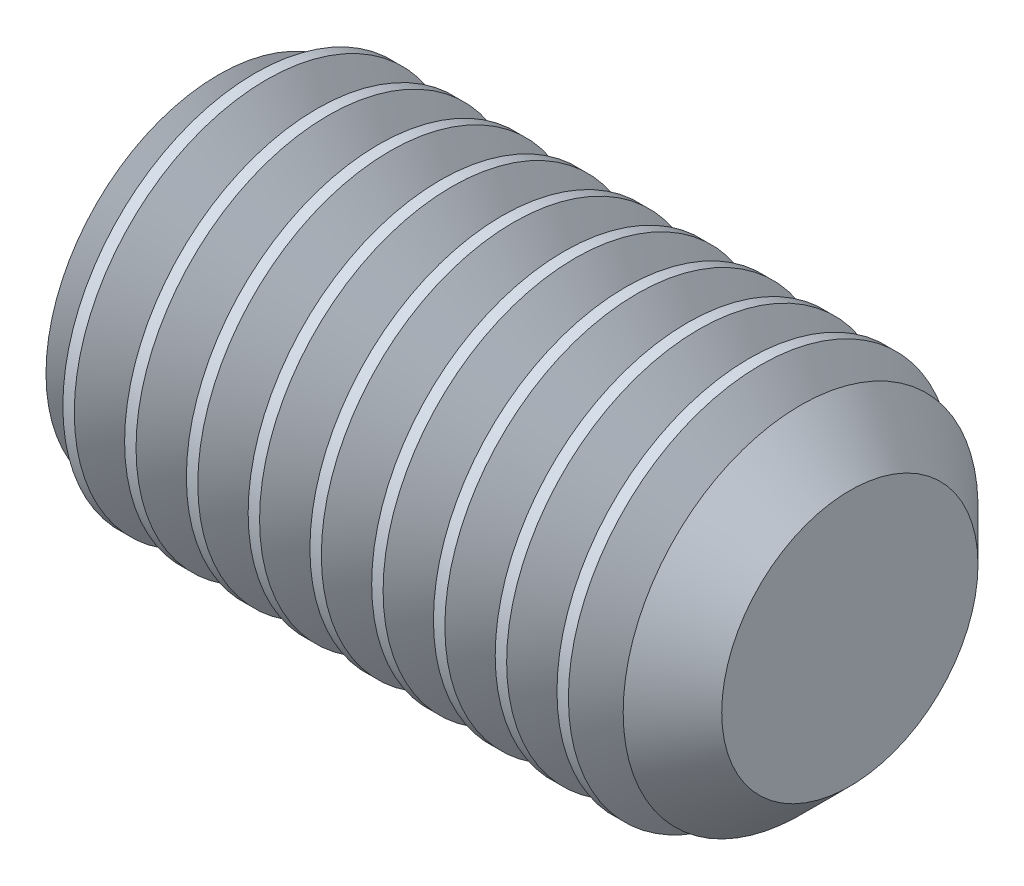
ISO-10303-21;
HEADER;
FILE_DESCRIPTION(('STEP AP214'),'2;1');
FILE_NAME('part.step','',(''),(''),'','','');
FILE_SCHEMA(('AUTOMOTIVE_DESIGN { 1 0 10303 214 1 1 1 1 }'));
ENDSEC;
DATA;
#1=APPLICATION_CONTEXT('core data for automotive mechanical design processes');
#2=APPLICATION_PROTOCOL_DEFINITION('international standard','automotive_design',2000,#1);
#3=PRODUCT_CONTEXT('',#1,'mechanical');
#4=PRODUCT('Part','Part','',(#3));
#5=PRODUCT_RELATED_PRODUCT_CATEGORY('part','',(#4));
#6=PRODUCT_DEFINITION_FORMATION('','',#4);
#7=PRODUCT_DEFINITION_CONTEXT('part definition',#1,'design');
#8=PRODUCT_DEFINITION('design','',#6,#7);
#9=PRODUCT_DEFINITION_SHAPE('','',#8);
#10=(LENGTH_UNIT() NAMED_UNIT(*) SI_UNIT(.MILLI.,.METRE.));
#11=(NAMED_UNIT(*) PLANE_ANGLE_UNIT() SI_UNIT($,.RADIAN.));
#12=(NAMED_UNIT(*) SI_UNIT($,.STERADIAN.) SOLID_ANGLE_UNIT());
#13=UNCERTAINTY_MEASURE_WITH_UNIT(LENGTH_MEASURE(1.E-05),#10,'distance_accuracy_value','');
#14=(GEOMETRIC_REPRESENTATION_CONTEXT(3) GLOBAL_UNCERTAINTY_ASSIGNED_CONTEXT((#13)) GLOBAL_UNIT_ASSIGNED_CONTEXT((#10,
#11,#12)) REPRESENTATION_CONTEXT('',''));
#15=CARTESIAN_POINT('',(0.,0.,0.));
#16=DIRECTION('',(0.,0.,1.));
#17=DIRECTION('',(1.,0.,0.));
#18=AXIS2_PLACEMENT_3D('',#15,#16,#17);
#19=CARTESIAN_POINT('',(0.,0.,0.));
#20=DIRECTION('',(-1.,0.,0.));
#21=DIRECTION('',(0.,0.,1.));
#22=AXIS2_PLACEMENT_3D('',#19,#20,#21);
#23=PLANE('',#22);
#24=CARTESIAN_POINT('',(0.,0.,0.));
#25=DIRECTION('',(-1.,0.,0.));
#26=DIRECTION('',(0.,0.,1.));
#27=AXIS2_PLACEMENT_3D('',#24,#25,#26);
#28=CIRCLE('',#27,1.2195);
#29=CARTESIAN_POINT('',(0.,0.,1.2195));
#30=VERTEX_POINT('',#29);
#31=EDGE_CURVE('E46',#30,#30,#28,.T.);
#32=ORIENTED_EDGE('',*,*,#31,.T.);
#33=EDGE_LOOP('',(#32));
#34=FACE_BOUND('',#33,.T.);
#35=DIRECTION('',(0.,0.,-1.));
#36=VECTOR('',#35,1.);
#37=CARTESIAN_POINT('',(0.,0.750000000000003,0.433012701892217));
#38=LINE('',#37,#36);
#39=CARTESIAN_POINT('',(0.,0.750000000000003,0.433012701892217));
#40=VERTEX_POINT('',#39);
#41=CARTESIAN_POINT('',(0.,0.750000000000003,-0.433012701892222));
#42=VERTEX_POINT('',#41);
#43=EDGE_CURVE('E133',#40,#42,#38,.T.);
#44=ORIENTED_EDGE('',*,*,#43,.F.);
#45=DIRECTION('',(0.,-0.866025403784439,0.5));
#46=VECTOR('',#45,1.);
#47=CARTESIAN_POINT('',(0.,0.750000000000003,0.433012701892217));
#48=LINE('',#47,#46);
#49=CARTESIAN_POINT('',(0.,0.,0.866025403784436));
#50=VERTEX_POINT('',#49);
#51=EDGE_CURVE('E54',#40,#50,#48,.T.);
#52=ORIENTED_EDGE('',*,*,#51,.T.);
#53=DIRECTION('',(0.,0.866025403784439,0.5));
#54=VECTOR('',#53,1.);
#55=CARTESIAN_POINT('',(0.,-0.749999999999997,0.433012701892216));
#56=LINE('',#55,#54);
#57=CARTESIAN_POINT('',(0.,-0.749999999999997,0.433012701892216));
#58=VERTEX_POINT('',#57);
#59=EDGE_CURVE('E123',#58,#50,#56,.T.);
#60=ORIENTED_EDGE('',*,*,#59,.F.);
#61=DIRECTION('',(0.,0.,-1.));
#62=VECTOR('',#61,1.);
#63=CARTESIAN_POINT('',(0.,-0.749999999999997,0.433012701892216));
#64=LINE('',#63,#62);
#65=CARTESIAN_POINT('',(0.,-0.749999999999997,-0.433012701892222));
#66=VERTEX_POINT('',#65);
#67=EDGE_CURVE('E127',#58,#66,#64,.T.);
#68=ORIENTED_EDGE('',*,*,#67,.T.);
#69=DIRECTION('',(0.,0.866025403784439,-0.5));
#70=VECTOR('',#69,1.);
#71=CARTESIAN_POINT('',(0.,-0.749999999999997,-0.433012701892222));
#72=LINE('',#71,#70);
#73=CARTESIAN_POINT('',(0.,0.,-0.866025403784441));
#74=VERTEX_POINT('',#73);
#75=EDGE_CURVE('E130',#66,#74,#72,.T.);
#76=ORIENTED_EDGE('',*,*,#75,.T.);
#77=DIRECTION('',(0.,-0.866025403784439,-0.5));
#78=VECTOR('',#77,1.);
#79=CARTESIAN_POINT('',(0.,0.750000000000003,-0.433012701892222));
#80=LINE('',#79,#78);
#81=EDGE_CURVE('E112',#42,#74,#80,.T.);
#82=ORIENTED_EDGE('',*,*,#81,.F.);
#83=EDGE_LOOP('',(#44,#52,#60,#68,#76,#82));
#84=FACE_BOUND('',#83,.T.);
#85=ADVANCED_FACE('F37',(#34,#84),#23,.T.);
#86=CARTESIAN_POINT('',(0.,0.,0.));
#87=DIRECTION('',(1.,0.,0.));
#88=DIRECTION('',(0.,0.,-1.));
#89=AXIS2_PLACEMENT_3D('',#86,#87,#88);
#90=CONICAL_SURFACE('',#89,1.2195,1.0471975511966);
#91=CARTESIAN_POINT('',(0.0731865121550403,0.,0.));
#92=DIRECTION('',(-1.,0.,0.));
#93=DIRECTION('',(0.,-1.,0.));
#94=AXIS2_PLACEMENT_3D('',#91,#92,#93);
#95=CIRCLE('',#94,1.34626275748129);
#96=CARTESIAN_POINT('',(0.0731865121550405,-1.34626275748129,0.));
#97=VERTEX_POINT('',#96);
#98=EDGE_CURVE('E124',#97,#97,#95,.F.);
#99=ORIENTED_EDGE('',*,*,#98,.F.);
#100=EDGE_LOOP('',(#99));
#101=FACE_BOUND('',#100,.T.);
#102=ORIENTED_EDGE('',*,*,#31,.F.);
#103=EDGE_LOOP('',(#102));
#104=FACE_BOUND('',#103,.T.);
#105=ADVANCED_FACE('F169',(#101,#104),#90,.T.);
#106=CARTESIAN_POINT('',(2.1,0.750000000000003,0.433012701892217));
#107=DIRECTION('',(0.,-0.5,-0.866025403784439));
#108=DIRECTION('',(0.,0.866025403784439,-0.5));
#109=AXIS2_PLACEMENT_3D('',#106,#107,#108);
#110=PLANE('',#109);
#111=ORIENTED_EDGE('',*,*,#51,.F.);
#112=DIRECTION('',(-1.,0.,0.));
#113=VECTOR('',#112,1.);
#114=CARTESIAN_POINT('',(2.1,0.750000000000003,0.433012701892217));
#115=LINE('',#114,#113);
#116=CARTESIAN_POINT('',(2.1,0.750000000000003,0.433012701892217));
#117=VERTEX_POINT('',#116);
#118=EDGE_CURVE('E59',#117,#40,#115,.T.);
#119=ORIENTED_EDGE('',*,*,#118,.F.);
#120=DIRECTION('',(0.,-0.866025403784439,0.5));
#121=VECTOR('',#120,1.);
#122=CARTESIAN_POINT('',(2.1,0.750000000000003,0.433012701892217));
#123=LINE('',#122,#121);
#124=CARTESIAN_POINT('',(2.1,0.,0.866025403784436));
#125=VERTEX_POINT('',#124);
#126=EDGE_CURVE('E86',#117,#125,#123,.T.);
#127=ORIENTED_EDGE('',*,*,#126,.T.);
#128=DIRECTION('',(-1.,0.,0.));
#129=VECTOR('',#128,1.);
#130=CARTESIAN_POINT('',(2.1,0.,0.866025403784436));
#131=LINE('',#130,#129);
#132=EDGE_CURVE('E140',#125,#50,#131,.T.);
#133=ORIENTED_EDGE('',*,*,#132,.T.);
#134=EDGE_LOOP('',(#111,#119,#127,#133));
#135=FACE_BOUND('',#134,.T.);
#136=ADVANCED_FACE('F167',(#135),#110,.T.);
#137=CARTESIAN_POINT('',(2.1,-0.749999999999997,0.433012701892216));
#138=DIRECTION('',(0.,-0.5,0.866025403784439));
#139=DIRECTION('',(0.,-0.866025403784439,-0.5));
#140=AXIS2_PLACEMENT_3D('',#137,#138,#139);
#141=PLANE('',#140);
#142=ORIENTED_EDGE('',*,*,#59,.T.);
#143=ORIENTED_EDGE('',*,*,#132,.F.);
#144=DIRECTION('',(0.,0.866025403784439,0.5));
#145=VECTOR('',#144,1.);
#146=CARTESIAN_POINT('',(2.1,-0.749999999999997,0.433012701892216));
#147=LINE('',#146,#145);
#148=CARTESIAN_POINT('',(2.1,-0.749999999999997,0.433012701892216));
#149=VERTEX_POINT('',#148);
#150=EDGE_CURVE('E158',#149,#125,#147,.T.);
#151=ORIENTED_EDGE('',*,*,#150,.F.);
#152=DIRECTION('',(-1.,0.,0.));
#153=VECTOR('',#152,1.);
#154=CARTESIAN_POINT('',(2.1,-0.749999999999997,0.433012701892216));
#155=LINE('',#154,#153);
#156=EDGE_CURVE('E138',#149,#58,#155,.T.);
#157=ORIENTED_EDGE('',*,*,#156,.T.);
#158=EDGE_LOOP('',(#142,#143,#151,#157));
#159=FACE_BOUND('',#158,.T.);
#160=ADVANCED_FACE('F165',(#159),#141,.F.);
#161=CARTESIAN_POINT('',(2.1,-0.749999999999997,0.433012701892216));
#162=DIRECTION('',(0.,1.,0.));
#163=DIRECTION('',(0.,0.,1.));
#164=AXIS2_PLACEMENT_3D('',#161,#162,#163);
#165=PLANE('',#164);
#166=ORIENTED_EDGE('',*,*,#67,.F.);
#167=ORIENTED_EDGE('',*,*,#156,.F.);
#168=DIRECTION('',(0.,0.,-1.));
#169=VECTOR('',#168,1.);
#170=CARTESIAN_POINT('',(2.1,-0.749999999999997,0.433012701892216));
#171=LINE('',#170,#169);
#172=CARTESIAN_POINT('',(2.1,-0.749999999999997,-0.433012701892222));
#173=VERTEX_POINT('',#172);
#174=EDGE_CURVE('E107',#149,#173,#171,.T.);
#175=ORIENTED_EDGE('',*,*,#174,.T.);
#176=DIRECTION('',(-1.,0.,0.));
#177=VECTOR('',#176,1.);
#178=CARTESIAN_POINT('',(2.1,-0.749999999999997,-0.433012701892222));
#179=LINE('',#178,#177);
#180=EDGE_CURVE('E102',#173,#66,#179,.T.);
#181=ORIENTED_EDGE('',*,*,#180,.T.);
#182=EDGE_LOOP('',(#166,#167,#175,#181));
#183=FACE_BOUND('',#182,.T.);
#184=ADVANCED_FACE('F162',(#183),#165,.T.);
#185=CARTESIAN_POINT('',(2.1,-0.749999999999997,-0.433012701892222));
#186=DIRECTION('',(0.,0.5,0.866025403784439));
#187=DIRECTION('',(0.,-0.866025403784439,0.5));
#188=AXIS2_PLACEMENT_3D('',#185,#186,#187);
#189=PLANE('',#188);
#190=ORIENTED_EDGE('',*,*,#75,.F.);
#191=ORIENTED_EDGE('',*,*,#180,.F.);
#192=DIRECTION('',(0.,0.866025403784439,-0.5));
#193=VECTOR('',#192,1.);
#194=CARTESIAN_POINT('',(2.1,-0.749999999999997,-0.433012701892222));
#195=LINE('',#194,#193);
#196=CARTESIAN_POINT('',(2.1,0.,-0.866025403784441));
#197=VERTEX_POINT('',#196);
#198=EDGE_CURVE('E97',#173,#197,#195,.T.);
#199=ORIENTED_EDGE('',*,*,#198,.T.);
#200=DIRECTION('',(-1.,0.,0.));
#201=VECTOR('',#200,1.);
#202=CARTESIAN_POINT('',(2.1,0.,-0.866025403784441));
#203=LINE('',#202,#201);
#204=EDGE_CURVE('E101',#197,#74,#203,.T.);
#205=ORIENTED_EDGE('',*,*,#204,.T.);
#206=EDGE_LOOP('',(#190,#191,#199,#205));
#207=FACE_BOUND('',#206,.T.);
#208=ADVANCED_FACE('F100',(#207),#189,.T.);
#209=CARTESIAN_POINT('',(2.1,0.750000000000003,-0.433012701892222));
#210=DIRECTION('',(0.,0.5,-0.866025403784439));
#211=DIRECTION('',(0.,0.866025403784439,0.5));
#212=AXIS2_PLACEMENT_3D('',#209,#210,#211);
#213=PLANE('',#212);
#214=ORIENTED_EDGE('',*,*,#81,.T.);
#215=ORIENTED_EDGE('',*,*,#204,.F.);
#216=DIRECTION('',(0.,-0.866025403784439,-0.5));
#217=VECTOR('',#216,1.);
#218=CARTESIAN_POINT('',(2.1,0.750000000000003,-0.433012701892222));
#219=LINE('',#218,#217);
#220=CARTESIAN_POINT('',(2.1,0.750000000000003,-0.433012701892222));
#221=VERTEX_POINT('',#220);
#222=EDGE_CURVE('E106',#221,#197,#219,.T.);
#223=ORIENTED_EDGE('',*,*,#222,.F.);
#224=DIRECTION('',(-1.,0.,0.));
#225=VECTOR('',#224,1.);
#226=CARTESIAN_POINT('',(2.1,0.750000000000003,-0.433012701892222));
#227=LINE('',#226,#225);
#228=EDGE_CURVE('E82',#221,#42,#227,.T.);
#229=ORIENTED_EDGE('',*,*,#228,.T.);
#230=EDGE_LOOP('',(#214,#215,#223,#229));
#231=FACE_BOUND('',#230,.T.);
#232=ADVANCED_FACE('F109',(#231),#213,.F.);
#233=CARTESIAN_POINT('',(2.1,0.750000000000003,0.433012701892217));
#234=DIRECTION('',(0.,1.,0.));
#235=DIRECTION('',(0.,0.,1.));
#236=AXIS2_PLACEMENT_3D('',#233,#234,#235);
#237=PLANE('',#236);
#238=ORIENTED_EDGE('',*,*,#43,.T.);
#239=ORIENTED_EDGE('',*,*,#228,.F.);
#240=DIRECTION('',(0.,0.,-1.));
#241=VECTOR('',#240,1.);
#242=CARTESIAN_POINT('',(2.1,0.750000000000003,0.433012701892217));
#243=LINE('',#242,#241);
#244=EDGE_CURVE('E117',#117,#221,#243,.T.);
#245=ORIENTED_EDGE('',*,*,#244,.F.);
#246=ORIENTED_EDGE('',*,*,#118,.T.);
#247=EDGE_LOOP('',(#238,#239,#245,#246));
#248=FACE_BOUND('',#247,.T.);
#249=ADVANCED_FACE('F412',(#248),#237,.F.);
#250=CARTESIAN_POINT('',(2.1,0.750000000000003,0.433012701892217));
#251=DIRECTION('',(1.,0.,0.));
#252=DIRECTION('',(0.,0.,-1.));
#253=AXIS2_PLACEMENT_3D('',#250,#251,#252);
#254=PLANE('',#253);
#255=ORIENTED_EDGE('',*,*,#126,.F.);
#256=ORIENTED_EDGE('',*,*,#244,.T.);
#257=ORIENTED_EDGE('',*,*,#222,.T.);
#258=ORIENTED_EDGE('',*,*,#198,.F.);
#259=ORIENTED_EDGE('',*,*,#174,.F.);
#260=ORIENTED_EDGE('',*,*,#150,.T.);
#261=EDGE_LOOP('',(#255,#256,#257,#258,#259,#260));
#262=FACE_BOUND('',#261,.T.);
#263=ADVANCED_FACE('F115',(#262),#254,.F.);
#264=CARTESIAN_POINT('',(0.358354964975511,0.,0.));
#265=DIRECTION('',(1.,0.,0.));
#266=DIRECTION('',(0.,1.,0.));
#267=AXIS2_PLACEMENT_3D('',#264,#265,#266);
#268=CONICAL_SURFACE('',#267,1.5,0.959931088596883);
#269=CARTESIAN_POINT('',(0.161946750507689,0.,0.));
#270=DIRECTION('',(-1.,0.,0.));
#271=DIRECTION('',(0.,-1.,0.));
#272=AXIS2_PLACEMENT_3D('',#269,#270,#271);
#273=CIRCLE('',#272,1.2195);
#274=CARTESIAN_POINT('',(0.161946750507689,-1.2195,0.));
#275=VERTEX_POINT('',#274);
#276=EDGE_CURVE('E148',#275,#275,#273,.T.);
#277=ORIENTED_EDGE('',*,*,#276,.F.);
#278=EDGE_LOOP('',(#277));
#279=FACE_BOUND('',#278,.T.);
#280=CARTESIAN_POINT('',(0.358354964975511,0.,0.));
#281=DIRECTION('',(-1.,0.,0.));
#282=DIRECTION('',(0.,-1.,0.));
#283=AXIS2_PLACEMENT_3D('',#280,#281,#282);
#284=CIRCLE('',#283,1.5);
#285=CARTESIAN_POINT('',(0.358354964975512,-1.5,0.));
#286=VERTEX_POINT('',#285);
#287=EDGE_CURVE('E144',#286,#286,#284,.T.);
#288=ORIENTED_EDGE('',*,*,#287,.T.);
#289=EDGE_LOOP('',(#288));
#290=FACE_BOUND('',#289,.T.);
#291=ADVANCED_FACE('F406',(#279,#290),#268,.T.);
#292=CARTESIAN_POINT('',(0.161946750507689,0.,0.));
#293=DIRECTION('',(-1.,0.,0.));
#294=DIRECTION('',(0.,-1.,0.));
#295=AXIS2_PLACEMENT_3D('',#292,#293,#294);
#296=CONICAL_SURFACE('',#295,1.2195,0.959931088596876);
#297=ORIENTED_EDGE('',*,*,#98,.T.);
#298=EDGE_LOOP('',(#297));
#299=FACE_BOUND('',#298,.T.);
#300=ORIENTED_EDGE('',*,*,#276,.T.);
#301=EDGE_LOOP('',(#300));
#302=FACE_BOUND('',#301,.T.);
#303=ADVANCED_FACE('F188',(#299,#302),#296,.T.);
#304=CARTESIAN_POINT('',(-12.7,0.,0.));
#305=DIRECTION('',(-1.,0.,0.));
#306=DIRECTION('',(0.,0.,1.));
#307=AXIS2_PLACEMENT_3D('',#304,#305,#306);
#308=CYLINDRICAL_SURFACE('',#307,1.5);
#309=CARTESIAN_POINT('',(0.447544458966775,0.,0.));
#310=DIRECTION('',(-1.,0.,0.));
#311=DIRECTION('',(0.,-1.,0.));
#312=AXIS2_PLACEMENT_3D('',#309,#310,#311);
#313=CIRCLE('',#312,1.5);
#314=CARTESIAN_POINT('',(0.447544458966776,-1.5,0.));
#315=VERTEX_POINT('',#314);
#316=EDGE_CURVE('E280',#315,#315,#313,.T.);
#317=ORIENTED_EDGE('',*,*,#316,.T.);
#318=EDGE_LOOP('',(#317));
#319=FACE_BOUND('',#318,.T.);
#320=ORIENTED_EDGE('',*,*,#287,.F.);
#321=EDGE_LOOP('',(#320));
#322=FACE_BOUND('',#321,.T.);
#323=ADVANCED_FACE('F185',(#319,#322),#308,.T.);
#324=CARTESIAN_POINT('',(0.840360887902424,0.,0.));
#325=DIRECTION('',(1.,0.,0.));
#326=DIRECTION('',(0.,1.,0.));
#327=AXIS2_PLACEMENT_3D('',#324,#325,#326);
#328=CONICAL_SURFACE('',#327,1.5,0.959931088596883);
#329=CARTESIAN_POINT('',(0.643952673434601,0.,0.));
#330=DIRECTION('',(-1.,0.,0.));
#331=DIRECTION('',(0.,-1.,0.));
#332=AXIS2_PLACEMENT_3D('',#329,#330,#331);
#333=CIRCLE('',#332,1.2195);
#334=CARTESIAN_POINT('',(0.643952673434601,-1.2195,0.));
#335=VERTEX_POINT('',#334);
#336=EDGE_CURVE('E277',#335,#335,#333,.T.);
#337=ORIENTED_EDGE('',*,*,#336,.F.);
#338=EDGE_LOOP('',(#337));
#339=FACE_BOUND('',#338,.T.);
#340=CARTESIAN_POINT('',(0.840360887902424,0.,0.));
#341=DIRECTION('',(-1.,0.,0.));
#342=DIRECTION('',(0.,-1.,0.));
#343=AXIS2_PLACEMENT_3D('',#340,#341,#342);
#344=CIRCLE('',#343,1.5);
#345=CARTESIAN_POINT('',(0.840360887902424,-1.5,0.));
#346=VERTEX_POINT('',#345);
#347=EDGE_CURVE('E153',#346,#346,#344,.T.);
#348=ORIENTED_EDGE('',*,*,#347,.T.);
#349=EDGE_LOOP('',(#348));
#350=FACE_BOUND('',#349,.T.);
#351=ADVANCED_FACE('F187',(#339,#350),#328,.T.);
#352=CARTESIAN_POINT('',(0.643952673434601,0.,0.));
#353=DIRECTION('',(-1.,0.,0.));
#354=DIRECTION('',(0.,-1.,0.));
#355=AXIS2_PLACEMENT_3D('',#352,#353,#354);
#356=CONICAL_SURFACE('',#355,1.2195,0.959931088596876);
#357=ORIENTED_EDGE('',*,*,#316,.F.);
#358=EDGE_LOOP('',(#357));
#359=FACE_BOUND('',#358,.T.);
#360=ORIENTED_EDGE('',*,*,#336,.T.);
#361=EDGE_LOOP('',(#360));
#362=FACE_BOUND('',#361,.T.);
#363=ADVANCED_FACE('F288',(#359,#362),#356,.T.);
#364=CARTESIAN_POINT('',(0.929550381893688,0.,0.));
#365=DIRECTION('',(-1.,0.,0.));
#366=DIRECTION('',(0.,-1.,0.));
#367=AXIS2_PLACEMENT_3D('',#364,#365,#366);
#368=CIRCLE('',#367,1.5);
#369=CARTESIAN_POINT('',(0.929550381893688,-1.5,0.));
#370=VERTEX_POINT('',#369);
#371=EDGE_CURVE('E271',#370,#370,#368,.T.);
#372=ORIENTED_EDGE('',*,*,#371,.T.);
#373=EDGE_LOOP('',(#372));
#374=FACE_BOUND('',#373,.T.);
#375=ORIENTED_EDGE('',*,*,#347,.F.);
#376=EDGE_LOOP('',(#375));
#377=FACE_BOUND('',#376,.T.);
#378=ADVANCED_FACE('F191',(#374,#377),#308,.T.);
#379=CARTESIAN_POINT('',(1.32236681082934,0.,0.));
#380=DIRECTION('',(1.,0.,0.));
#381=DIRECTION('',(0.,1.,0.));
#382=AXIS2_PLACEMENT_3D('',#379,#380,#381);
#383=CONICAL_SURFACE('',#382,1.5,0.959931088596883);
#384=CARTESIAN_POINT('',(1.12595859636151,0.,0.));
#385=DIRECTION('',(-1.,0.,0.));
#386=DIRECTION('',(0.,-1.,0.));
#387=AXIS2_PLACEMENT_3D('',#384,#385,#386);
#388=CIRCLE('',#387,1.2195);
#389=CARTESIAN_POINT('',(1.12595859636151,-1.2195,0.));
#390=VERTEX_POINT('',#389);
#391=EDGE_CURVE('E268',#390,#390,#388,.T.);
#392=ORIENTED_EDGE('',*,*,#391,.F.);
#393=EDGE_LOOP('',(#392));
#394=FACE_BOUND('',#393,.T.);
#395=CARTESIAN_POINT('',(1.32236681082934,0.,0.));
#396=DIRECTION('',(-1.,0.,0.));
#397=DIRECTION('',(0.,-1.,0.));
#398=AXIS2_PLACEMENT_3D('',#395,#396,#397);
#399=CIRCLE('',#398,1.5);
#400=CARTESIAN_POINT('',(1.32236681082934,-1.5,0.));
#401=VERTEX_POINT('',#400);
#402=EDGE_CURVE('E274',#401,#401,#399,.T.);
#403=ORIENTED_EDGE('',*,*,#402,.T.);
#404=EDGE_LOOP('',(#403));
#405=FACE_BOUND('',#404,.T.);
#406=ADVANCED_FACE('F287',(#394,#405),#383,.T.);
#407=CARTESIAN_POINT('',(1.12595859636151,0.,0.));
#408=DIRECTION('',(-1.,0.,0.));
#409=DIRECTION('',(0.,-1.,0.));
#410=AXIS2_PLACEMENT_3D('',#407,#408,#409);
#411=CONICAL_SURFACE('',#410,1.2195,0.959931088596876);
#412=ORIENTED_EDGE('',*,*,#371,.F.);
#413=EDGE_LOOP('',(#412));
#414=FACE_BOUND('',#413,.T.);
#415=ORIENTED_EDGE('',*,*,#391,.T.);
#416=EDGE_LOOP('',(#415));
#417=FACE_BOUND('',#416,.T.);
#418=ADVANCED_FACE('F295',(#414,#417),#411,.T.);
#419=CARTESIAN_POINT('',(1.4115563048206,0.,0.));
#420=DIRECTION('',(-1.,0.,0.));
#421=DIRECTION('',(0.,-1.,0.));
#422=AXIS2_PLACEMENT_3D('',#419,#420,#421);
#423=CIRCLE('',#422,1.5);
#424=CARTESIAN_POINT('',(1.4115563048206,-1.5,0.));
#425=VERTEX_POINT('',#424);
#426=EDGE_CURVE('E262',#425,#425,#423,.T.);
#427=ORIENTED_EDGE('',*,*,#426,.T.);
#428=EDGE_LOOP('',(#427));
#429=FACE_BOUND('',#428,.T.);
#430=ORIENTED_EDGE('',*,*,#402,.F.);
#431=EDGE_LOOP('',(#430));
#432=FACE_BOUND('',#431,.T.);
#433=ADVANCED_FACE('F290',(#429,#432),#308,.T.);
#434=CARTESIAN_POINT('',(1.80437273375625,0.,0.));
#435=DIRECTION('',(1.,0.,0.));
#436=DIRECTION('',(0.,1.,0.));
#437=AXIS2_PLACEMENT_3D('',#434,#435,#436);
#438=CONICAL_SURFACE('',#437,1.5,0.959931088596883);
#439=CARTESIAN_POINT('',(1.60796451928843,0.,0.));
#440=DIRECTION('',(-1.,0.,0.));
#441=DIRECTION('',(0.,-1.,0.));
#442=AXIS2_PLACEMENT_3D('',#439,#440,#441);
#443=CIRCLE('',#442,1.2195);
#444=CARTESIAN_POINT('',(1.60796451928843,-1.2195,0.));
#445=VERTEX_POINT('',#444);
#446=EDGE_CURVE('E259',#445,#445,#443,.T.);
#447=ORIENTED_EDGE('',*,*,#446,.F.);
#448=EDGE_LOOP('',(#447));
#449=FACE_BOUND('',#448,.T.);
#450=CARTESIAN_POINT('',(1.80437273375625,0.,0.));
#451=DIRECTION('',(-1.,0.,0.));
#452=DIRECTION('',(0.,-1.,0.));
#453=AXIS2_PLACEMENT_3D('',#450,#451,#452);
#454=CIRCLE('',#453,1.5);
#455=CARTESIAN_POINT('',(1.80437273375625,-1.5,0.));
#456=VERTEX_POINT('',#455);
#457=EDGE_CURVE('E265',#456,#456,#454,.T.);
#458=ORIENTED_EDGE('',*,*,#457,.T.);
#459=EDGE_LOOP('',(#458));
#460=FACE_BOUND('',#459,.T.);
#461=ADVANCED_FACE('F301',(#449,#460),#438,.T.);
#462=CARTESIAN_POINT('',(1.60796451928843,0.,0.));
#463=DIRECTION('',(-1.,0.,0.));
#464=DIRECTION('',(0.,-1.,0.));
#465=AXIS2_PLACEMENT_3D('',#462,#463,#464);
#466=CONICAL_SURFACE('',#465,1.2195,0.959931088596876);
#467=ORIENTED_EDGE('',*,*,#426,.F.);
#468=EDGE_LOOP('',(#467));
#469=FACE_BOUND('',#468,.T.);
#470=ORIENTED_EDGE('',*,*,#446,.T.);
#471=EDGE_LOOP('',(#470));
#472=FACE_BOUND('',#471,.T.);
#473=ADVANCED_FACE('F308',(#469,#472),#466,.T.);
#474=CARTESIAN_POINT('',(1.89356222774751,0.,0.));
#475=DIRECTION('',(-1.,0.,0.));
#476=DIRECTION('',(0.,-1.,0.));
#477=AXIS2_PLACEMENT_3D('',#474,#475,#476);
#478=CIRCLE('',#477,1.5);
#479=CARTESIAN_POINT('',(1.89356222774751,-1.5,0.));
#480=VERTEX_POINT('',#479);
#481=EDGE_CURVE('E253',#480,#480,#478,.T.);
#482=ORIENTED_EDGE('',*,*,#481,.T.);
#483=EDGE_LOOP('',(#482));
#484=FACE_BOUND('',#483,.T.);
#485=ORIENTED_EDGE('',*,*,#457,.F.);
#486=EDGE_LOOP('',(#485));
#487=FACE_BOUND('',#486,.T.);
#488=ADVANCED_FACE('F303',(#484,#487),#308,.T.);
#489=CARTESIAN_POINT('',(2.28637865668316,0.,0.));
#490=DIRECTION('',(1.,0.,0.));
#491=DIRECTION('',(0.,1.,0.));
#492=AXIS2_PLACEMENT_3D('',#489,#490,#491);
#493=CONICAL_SURFACE('',#492,1.5,0.959931088596883);
#494=CARTESIAN_POINT('',(2.08997044221534,0.,0.));
#495=DIRECTION('',(-1.,0.,0.));
#496=DIRECTION('',(0.,-1.,0.));
#497=AXIS2_PLACEMENT_3D('',#494,#495,#496);
#498=CIRCLE('',#497,1.2195);
#499=CARTESIAN_POINT('',(2.08997044221534,-1.2195,0.));
#500=VERTEX_POINT('',#499);
#501=EDGE_CURVE('E250',#500,#500,#498,.T.);
#502=ORIENTED_EDGE('',*,*,#501,.F.);
#503=EDGE_LOOP('',(#502));
#504=FACE_BOUND('',#503,.T.);
#505=CARTESIAN_POINT('',(2.28637865668316,0.,0.));
#506=DIRECTION('',(-1.,0.,0.));
#507=DIRECTION('',(0.,-1.,0.));
#508=AXIS2_PLACEMENT_3D('',#505,#506,#507);
#509=CIRCLE('',#508,1.5);
#510=CARTESIAN_POINT('',(2.28637865668316,-1.5,0.));
#511=VERTEX_POINT('',#510);
#512=EDGE_CURVE('E256',#511,#511,#509,.T.);
#513=ORIENTED_EDGE('',*,*,#512,.T.);
#514=EDGE_LOOP('',(#513));
#515=FACE_BOUND('',#514,.T.);
#516=ADVANCED_FACE('F315',(#504,#515),#493,.T.);
#517=CARTESIAN_POINT('',(2.08997044221534,0.,0.));
#518=DIRECTION('',(-1.,0.,0.));
#519=DIRECTION('',(0.,-1.,0.));
#520=AXIS2_PLACEMENT_3D('',#517,#518,#519);
#521=CONICAL_SURFACE('',#520,1.2195,0.959931088596876);
#522=ORIENTED_EDGE('',*,*,#481,.F.);
#523=EDGE_LOOP('',(#522));
#524=FACE_BOUND('',#523,.T.);
#525=ORIENTED_EDGE('',*,*,#501,.T.);
#526=EDGE_LOOP('',(#525));
#527=FACE_BOUND('',#526,.T.);
#528=ADVANCED_FACE('F322',(#524,#527),#521,.T.);
#529=CARTESIAN_POINT('',(2.37556815067443,0.,0.));
#530=DIRECTION('',(-1.,0.,0.));
#531=DIRECTION('',(0.,-1.,0.));
#532=AXIS2_PLACEMENT_3D('',#529,#530,#531);
#533=CIRCLE('',#532,1.5);
#534=CARTESIAN_POINT('',(2.37556815067443,-1.5,0.));
#535=VERTEX_POINT('',#534);
#536=EDGE_CURVE('E244',#535,#535,#533,.T.);
#537=ORIENTED_EDGE('',*,*,#536,.T.);
#538=EDGE_LOOP('',(#537));
#539=FACE_BOUND('',#538,.T.);
#540=ORIENTED_EDGE('',*,*,#512,.F.);
#541=EDGE_LOOP('',(#540));
#542=FACE_BOUND('',#541,.T.);
#543=ADVANCED_FACE('F317',(#539,#542),#308,.T.);
#544=CARTESIAN_POINT('',(2.76838457961007,0.,0.));
#545=DIRECTION('',(1.,0.,0.));
#546=DIRECTION('',(0.,1.,0.));
#547=AXIS2_PLACEMENT_3D('',#544,#545,#546);
#548=CONICAL_SURFACE('',#547,1.5,0.959931088596883);
#549=CARTESIAN_POINT('',(2.57197636514225,0.,0.));
#550=DIRECTION('',(-1.,0.,0.));
#551=DIRECTION('',(0.,-1.,0.));
#552=AXIS2_PLACEMENT_3D('',#549,#550,#551);
#553=CIRCLE('',#552,1.2195);
#554=CARTESIAN_POINT('',(2.57197636514225,-1.2195,0.));
#555=VERTEX_POINT('',#554);
#556=EDGE_CURVE('E241',#555,#555,#553,.T.);
#557=ORIENTED_EDGE('',*,*,#556,.F.);
#558=EDGE_LOOP('',(#557));
#559=FACE_BOUND('',#558,.T.);
#560=CARTESIAN_POINT('',(2.76838457961007,0.,0.));
#561=DIRECTION('',(-1.,0.,0.));
#562=DIRECTION('',(0.,-1.,0.));
#563=AXIS2_PLACEMENT_3D('',#560,#561,#562);
#564=CIRCLE('',#563,1.5);
#565=CARTESIAN_POINT('',(2.76838457961007,-1.5,0.));
#566=VERTEX_POINT('',#565);
#567=EDGE_CURVE('E247',#566,#566,#564,.T.);
#568=ORIENTED_EDGE('',*,*,#567,.T.);
#569=EDGE_LOOP('',(#568));
#570=FACE_BOUND('',#569,.T.);
#571=ADVANCED_FACE('F329',(#559,#570),#548,.T.);
#572=CARTESIAN_POINT('',(2.57197636514225,0.,0.));
#573=DIRECTION('',(-1.,0.,0.));
#574=DIRECTION('',(0.,-1.,0.));
#575=AXIS2_PLACEMENT_3D('',#572,#573,#574);
#576=CONICAL_SURFACE('',#575,1.2195,0.959931088596876);
#577=ORIENTED_EDGE('',*,*,#536,.F.);
#578=EDGE_LOOP('',(#577));
#579=FACE_BOUND('',#578,.T.);
#580=ORIENTED_EDGE('',*,*,#556,.T.);
#581=EDGE_LOOP('',(#580));
#582=FACE_BOUND('',#581,.T.);
#583=ADVANCED_FACE('F336',(#579,#582),#576,.T.);
#584=CARTESIAN_POINT('',(2.85757407360134,0.,0.));
#585=DIRECTION('',(-1.,0.,0.));
#586=DIRECTION('',(0.,-1.,0.));
#587=AXIS2_PLACEMENT_3D('',#584,#585,#586);
#588=CIRCLE('',#587,1.5);
#589=CARTESIAN_POINT('',(2.85757407360134,-1.5,0.));
#590=VERTEX_POINT('',#589);
#591=EDGE_CURVE('E235',#590,#590,#588,.T.);
#592=ORIENTED_EDGE('',*,*,#591,.T.);
#593=EDGE_LOOP('',(#592));
#594=FACE_BOUND('',#593,.T.);
#595=ORIENTED_EDGE('',*,*,#567,.F.);
#596=EDGE_LOOP('',(#595));
#597=FACE_BOUND('',#596,.T.);
#598=ADVANCED_FACE('F331',(#594,#597),#308,.T.);
#599=CARTESIAN_POINT('',(3.25039050253699,0.,0.));
#600=DIRECTION('',(1.,0.,0.));
#601=DIRECTION('',(0.,1.,0.));
#602=AXIS2_PLACEMENT_3D('',#599,#600,#601);
#603=CONICAL_SURFACE('',#602,1.5,0.959931088596883);
#604=CARTESIAN_POINT('',(3.05398228806916,0.,0.));
#605=DIRECTION('',(-1.,0.,0.));
#606=DIRECTION('',(0.,-1.,0.));
#607=AXIS2_PLACEMENT_3D('',#604,#605,#606);
#608=CIRCLE('',#607,1.2195);
#609=CARTESIAN_POINT('',(3.05398228806916,-1.2195,0.));
#610=VERTEX_POINT('',#609);
#611=EDGE_CURVE('E232',#610,#610,#608,.T.);
#612=ORIENTED_EDGE('',*,*,#611,.F.);
#613=EDGE_LOOP('',(#612));
#614=FACE_BOUND('',#613,.T.);
#615=CARTESIAN_POINT('',(3.25039050253699,0.,0.));
#616=DIRECTION('',(-1.,0.,0.));
#617=DIRECTION('',(0.,-1.,0.));
#618=AXIS2_PLACEMENT_3D('',#615,#616,#617);
#619=CIRCLE('',#618,1.5);
#620=CARTESIAN_POINT('',(3.25039050253699,-1.5,0.));
#621=VERTEX_POINT('',#620);
#622=EDGE_CURVE('E238',#621,#621,#619,.T.);
#623=ORIENTED_EDGE('',*,*,#622,.T.);
#624=EDGE_LOOP('',(#623));
#625=FACE_BOUND('',#624,.T.);
#626=ADVANCED_FACE('F343',(#614,#625),#603,.T.);
#627=CARTESIAN_POINT('',(3.05398228806916,0.,0.));
#628=DIRECTION('',(-1.,0.,0.));
#629=DIRECTION('',(0.,-1.,0.));
#630=AXIS2_PLACEMENT_3D('',#627,#628,#629);
#631=CONICAL_SURFACE('',#630,1.2195,0.959931088596876);
#632=ORIENTED_EDGE('',*,*,#591,.F.);
#633=EDGE_LOOP('',(#632));
#634=FACE_BOUND('',#633,.T.);
#635=ORIENTED_EDGE('',*,*,#611,.T.);
#636=EDGE_LOOP('',(#635));
#637=FACE_BOUND('',#636,.T.);
#638=ADVANCED_FACE('F350',(#634,#637),#631,.T.);
#639=CARTESIAN_POINT('',(3.33957999652825,0.,0.));
#640=DIRECTION('',(-1.,0.,0.));
#641=DIRECTION('',(0.,-1.,0.));
#642=AXIS2_PLACEMENT_3D('',#639,#640,#641);
#643=CIRCLE('',#642,1.5);
#644=CARTESIAN_POINT('',(3.33957999652825,-1.5,0.));
#645=VERTEX_POINT('',#644);
#646=EDGE_CURVE('E226',#645,#645,#643,.T.);
#647=ORIENTED_EDGE('',*,*,#646,.T.);
#648=EDGE_LOOP('',(#647));
#649=FACE_BOUND('',#648,.T.);
#650=ORIENTED_EDGE('',*,*,#622,.F.);
#651=EDGE_LOOP('',(#650));
#652=FACE_BOUND('',#651,.T.);
#653=ADVANCED_FACE('F345',(#649,#652),#308,.T.);
#654=CARTESIAN_POINT('',(3.7323964254639,0.,0.));
#655=DIRECTION('',(1.,0.,0.));
#656=DIRECTION('',(0.,1.,0.));
#657=AXIS2_PLACEMENT_3D('',#654,#655,#656);
#658=CONICAL_SURFACE('',#657,1.5,0.959931088596883);
#659=CARTESIAN_POINT('',(3.53598821099608,0.,0.));
#660=DIRECTION('',(-1.,0.,0.));
#661=DIRECTION('',(0.,-1.,0.));
#662=AXIS2_PLACEMENT_3D('',#659,#660,#661);
#663=CIRCLE('',#662,1.2195);
#664=CARTESIAN_POINT('',(3.53598821099608,-1.2195,0.));
#665=VERTEX_POINT('',#664);
#666=EDGE_CURVE('E223',#665,#665,#663,.T.);
#667=ORIENTED_EDGE('',*,*,#666,.F.);
#668=EDGE_LOOP('',(#667));
#669=FACE_BOUND('',#668,.T.);
#670=CARTESIAN_POINT('',(3.7323964254639,0.,0.));
#671=DIRECTION('',(-1.,0.,0.));
#672=DIRECTION('',(0.,-1.,0.));
#673=AXIS2_PLACEMENT_3D('',#670,#671,#672);
#674=CIRCLE('',#673,1.5);
#675=CARTESIAN_POINT('',(3.7323964254639,-1.5,0.));
#676=VERTEX_POINT('',#675);
#677=EDGE_CURVE('E229',#676,#676,#674,.T.);
#678=ORIENTED_EDGE('',*,*,#677,.T.);
#679=EDGE_LOOP('',(#678));
#680=FACE_BOUND('',#679,.T.);
#681=ADVANCED_FACE('F357',(#669,#680),#658,.T.);
#682=CARTESIAN_POINT('',(3.53598821099608,0.,0.));
#683=DIRECTION('',(-1.,0.,0.));
#684=DIRECTION('',(0.,-1.,0.));
#685=AXIS2_PLACEMENT_3D('',#682,#683,#684);
#686=CONICAL_SURFACE('',#685,1.2195,0.959931088596876);
#687=ORIENTED_EDGE('',*,*,#646,.F.);
#688=EDGE_LOOP('',(#687));
#689=FACE_BOUND('',#688,.T.);
#690=ORIENTED_EDGE('',*,*,#666,.T.);
#691=EDGE_LOOP('',(#690));
#692=FACE_BOUND('',#691,.T.);
#693=ADVANCED_FACE('F364',(#689,#692),#686,.T.);
#694=CARTESIAN_POINT('',(3.82158591945516,0.,0.));
#695=DIRECTION('',(-1.,0.,0.));
#696=DIRECTION('',(0.,-1.,0.));
#697=AXIS2_PLACEMENT_3D('',#694,#695,#696);
#698=CIRCLE('',#697,1.5);
#699=CARTESIAN_POINT('',(3.82158591945516,-1.5,0.));
#700=VERTEX_POINT('',#699);
#701=EDGE_CURVE('E208',#700,#700,#698,.T.);
#702=ORIENTED_EDGE('',*,*,#701,.T.);
#703=EDGE_LOOP('',(#702));
#704=FACE_BOUND('',#703,.T.);
#705=ORIENTED_EDGE('',*,*,#677,.F.);
#706=EDGE_LOOP('',(#705));
#707=FACE_BOUND('',#706,.T.);
#708=ADVANCED_FACE('F359',(#704,#707),#308,.T.);
#709=CARTESIAN_POINT('',(4.21440234839081,0.,0.));
#710=DIRECTION('',(1.,0.,0.));
#711=DIRECTION('',(0.,1.,0.));
#712=AXIS2_PLACEMENT_3D('',#709,#710,#711);
#713=CONICAL_SURFACE('',#712,1.5,0.959931088596883);
#714=CARTESIAN_POINT('',(4.01799413392299,0.,0.));
#715=DIRECTION('',(-1.,0.,0.));
#716=DIRECTION('',(0.,-1.,0.));
#717=AXIS2_PLACEMENT_3D('',#714,#715,#716);
#718=CIRCLE('',#717,1.2195);
#719=CARTESIAN_POINT('',(4.01799413392299,-1.2195,0.));
#720=VERTEX_POINT('',#719);
#721=EDGE_CURVE('E205',#720,#720,#718,.T.);
#722=ORIENTED_EDGE('',*,*,#721,.F.);
#723=EDGE_LOOP('',(#722));
#724=FACE_BOUND('',#723,.T.);
#725=CARTESIAN_POINT('',(4.21440234839081,0.,0.));
#726=DIRECTION('',(-1.,0.,0.));
#727=DIRECTION('',(0.,-1.,0.));
#728=AXIS2_PLACEMENT_3D('',#725,#726,#727);
#729=CIRCLE('',#728,1.5);
#730=CARTESIAN_POINT('',(4.21440234839081,-1.5,0.));
#731=VERTEX_POINT('',#730);
#732=EDGE_CURVE('E220',#731,#731,#729,.T.);
#733=ORIENTED_EDGE('',*,*,#732,.T.);
#734=EDGE_LOOP('',(#733));
#735=FACE_BOUND('',#734,.T.);
#736=ADVANCED_FACE('F371',(#724,#735),#713,.T.);
#737=CARTESIAN_POINT('',(4.01799413392299,0.,0.));
#738=DIRECTION('',(-1.,0.,0.));
#739=DIRECTION('',(0.,-1.,0.));
#740=AXIS2_PLACEMENT_3D('',#737,#738,#739);
#741=CONICAL_SURFACE('',#740,1.2195,0.959931088596876);
#742=ORIENTED_EDGE('',*,*,#701,.F.);
#743=EDGE_LOOP('',(#742));
#744=FACE_BOUND('',#743,.T.);
#745=ORIENTED_EDGE('',*,*,#721,.T.);
#746=EDGE_LOOP('',(#745));
#747=FACE_BOUND('',#746,.T.);
#748=ADVANCED_FACE('F377',(#744,#747),#741,.T.);
#749=CARTESIAN_POINT('',(4.30359184238208,0.,0.));
#750=DIRECTION('',(-1.,0.,0.));
#751=DIRECTION('',(0.,-1.,0.));
#752=AXIS2_PLACEMENT_3D('',#749,#750,#751);
#753=CIRCLE('',#752,1.5);
#754=CARTESIAN_POINT('',(4.30359184238208,-1.5,0.));
#755=VERTEX_POINT('',#754);
#756=EDGE_CURVE('E206',#755,#755,#753,.T.);
#757=ORIENTED_EDGE('',*,*,#756,.T.);
#758=EDGE_LOOP('',(#757));
#759=FACE_BOUND('',#758,.T.);
#760=ORIENTED_EDGE('',*,*,#732,.F.);
#761=EDGE_LOOP('',(#760));
#762=FACE_BOUND('',#761,.T.);
#763=ADVANCED_FACE('F190',(#759,#762),#308,.T.);
#764=CARTESIAN_POINT('',(4.69640827131772,0.,0.));
#765=DIRECTION('',(1.,0.,0.));
#766=DIRECTION('',(0.,1.,0.));
#767=AXIS2_PLACEMENT_3D('',#764,#765,#766);
#768=CONICAL_SURFACE('',#767,1.5,0.959931088596883);
#769=CARTESIAN_POINT('',(4.61552017439268,0.,0.));
#770=DIRECTION('',(1.,0.,0.));
#771=DIRECTION('',(0.,1.,0.));
#772=AXIS2_PLACEMENT_3D('',#769,#770,#771);
#773=CIRCLE('',#772,1.38447982560733);
#774=CARTESIAN_POINT('',(4.61552017439268,1.38447982560733,0.));
#775=VERTEX_POINT('',#774);
#776=EDGE_CURVE('E41',#775,#775,#773,.F.);
#777=ORIENTED_EDGE('',*,*,#776,.T.);
#778=EDGE_LOOP('',(#777));
#779=FACE_BOUND('',#778,.T.);
#780=CARTESIAN_POINT('',(4.5000000568499,0.,0.));
#781=DIRECTION('',(-1.,0.,0.));
#782=DIRECTION('',(0.,-1.,0.));
#783=AXIS2_PLACEMENT_3D('',#780,#781,#782);
#784=CIRCLE('',#783,1.2195);
#785=CARTESIAN_POINT('',(4.5000000568499,-1.2195,0.));
#786=VERTEX_POINT('',#785);
#787=EDGE_CURVE('E211',#786,#786,#784,.T.);
#788=ORIENTED_EDGE('',*,*,#787,.F.);
#789=EDGE_LOOP('',(#788));
#790=FACE_BOUND('',#789,.T.);
#791=ADVANCED_FACE('F384',(#779,#790),#768,.T.);
#792=CARTESIAN_POINT('',(4.5000000568499,0.,0.));
#793=DIRECTION('',(-1.,0.,0.));
#794=DIRECTION('',(0.,-1.,0.));
#795=AXIS2_PLACEMENT_3D('',#792,#793,#794);
#796=CONICAL_SURFACE('',#795,1.2195,0.959931088596876);
#797=ORIENTED_EDGE('',*,*,#756,.F.);
#798=EDGE_LOOP('',(#797));
#799=FACE_BOUND('',#798,.T.);
#800=ORIENTED_EDGE('',*,*,#787,.T.);
#801=EDGE_LOOP('',(#800));
#802=FACE_BOUND('',#801,.T.);
#803=ADVANCED_FACE('F198',(#799,#802),#796,.T.);
#804=CARTESIAN_POINT('',(5.,1.,0.));
#805=DIRECTION('',(1.,0.,0.));
#806=DIRECTION('',(0.,0.,-1.));
#807=AXIS2_PLACEMENT_3D('',#804,#805,#806);
#808=PLANE('',#807);
#809=CARTESIAN_POINT('',(5.,0.,0.));
#810=DIRECTION('',(-1.,0.,0.));
#811=DIRECTION('',(0.,0.,1.));
#812=AXIS2_PLACEMENT_3D('',#809,#810,#811);
#813=CIRCLE('',#812,1.);
#814=CARTESIAN_POINT('',(5.,0.,1.));
#815=VERTEX_POINT('',#814);
#816=EDGE_CURVE('E11',#815,#815,#813,.T.);
#817=ORIENTED_EDGE('',*,*,#816,.F.);
#818=EDGE_LOOP('',(#817));
#819=FACE_BOUND('',#818,.T.);
#820=ADVANCED_FACE('F39',(#819),#808,.T.);
#821=CARTESIAN_POINT('',(4.50000000000001,0.,0.));
#822=DIRECTION('',(-1.,0.,0.));
#823=DIRECTION('',(0.,0.,1.));
#824=AXIS2_PLACEMENT_3D('',#821,#822,#823);
#825=CONICAL_SURFACE('',#824,1.5,0.785398163397455);
#826=ORIENTED_EDGE('',*,*,#776,.F.);
#827=EDGE_LOOP('',(#826));
#828=FACE_BOUND('',#827,.T.);
#829=ORIENTED_EDGE('',*,*,#816,.T.);
#830=EDGE_LOOP('',(#829));
#831=FACE_BOUND('',#830,.T.);
#832=ADVANCED_FACE('F192',(#828,#831),#825,.T.);
#833=CLOSED_SHELL('',(#85,#105,#136,#160,#184,#208,#232,#249,#263,#291,#303,#323,#351,#363,#378,
#406,#418,#433,#461,#473,#488,#516,#528,#543,#571,#583,#598,#626,#638,#653,#681,#693,#708,#736,
#748,#763,#791,#803,#820,#832));
#834=MANIFOLD_SOLID_BREP('B2',#833);
#835=ADVANCED_BREP_SHAPE_REPRESENTATION('',(#18,#834),#14);
#836=SHAPE_DEFINITION_REPRESENTATION(#9,#835);
ENDSEC;
END-ISO-10303-21;
